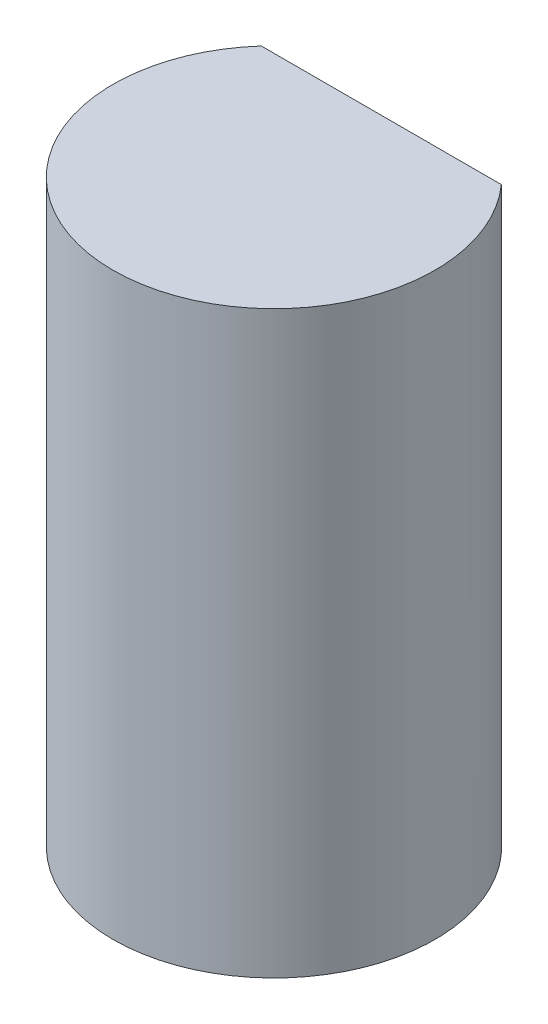
ISO-10303-21;
HEADER;
FILE_DESCRIPTION(('STEP AP214'),'2;1');
FILE_NAME('part.step','',(''),(''),'','','');
FILE_SCHEMA(('AUTOMOTIVE_DESIGN { 1 0 10303 214 1 1 1 1 }'));
ENDSEC;
DATA;
#1=APPLICATION_CONTEXT('core data for automotive mechanical design processes');
#2=APPLICATION_PROTOCOL_DEFINITION('international standard','automotive_design',2000,#1);
#3=PRODUCT_CONTEXT('',#1,'mechanical');
#4=PRODUCT('Part','Part','',(#3));
#5=PRODUCT_RELATED_PRODUCT_CATEGORY('part','',(#4));
#6=PRODUCT_DEFINITION_FORMATION('','',#4);
#7=PRODUCT_DEFINITION_CONTEXT('part definition',#1,'design');
#8=PRODUCT_DEFINITION('design','',#6,#7);
#9=PRODUCT_DEFINITION_SHAPE('','',#8);
#10=(LENGTH_UNIT() NAMED_UNIT(*) SI_UNIT(.MILLI.,.METRE.));
#11=(NAMED_UNIT(*) PLANE_ANGLE_UNIT() SI_UNIT($,.RADIAN.));
#12=(NAMED_UNIT(*) SI_UNIT($,.STERADIAN.) SOLID_ANGLE_UNIT());
#13=UNCERTAINTY_MEASURE_WITH_UNIT(LENGTH_MEASURE(1.E-05),#10,'distance_accuracy_value','');
#14=(GEOMETRIC_REPRESENTATION_CONTEXT(3) GLOBAL_UNCERTAINTY_ASSIGNED_CONTEXT((#13)) GLOBAL_UNIT_ASSIGNED_CONTEXT((#10,
#11,#12)) REPRESENTATION_CONTEXT('',''));
#15=CARTESIAN_POINT('',(0.,0.,0.));
#16=DIRECTION('',(0.,0.,1.));
#17=DIRECTION('',(1.,0.,0.));
#18=AXIS2_PLACEMENT_3D('',#15,#16,#17);
#19=CARTESIAN_POINT('',(0.,5.4,0.));
#20=DIRECTION('',(0.,-1.,0.));
#21=DIRECTION('',(0.,0.,-1.));
#22=AXIS2_PLACEMENT_3D('',#19,#20,#21);
#23=CYLINDRICAL_SURFACE('',#22,1.5);
#24=CARTESIAN_POINT('',(0.,5.4,0.));
#25=DIRECTION('',(0.,1.,0.));
#26=DIRECTION('',(0.,0.,1.));
#27=AXIS2_PLACEMENT_3D('',#24,#25,#26);
#28=CIRCLE('',#27,1.5);
#29=CARTESIAN_POINT('',(-1.1180339887499,5.4,-1.));
#30=VERTEX_POINT('',#29);
#31=CARTESIAN_POINT('',(1.1180339887499,5.4,-1.));
#32=VERTEX_POINT('',#31);
#33=EDGE_CURVE('E11',#30,#32,#28,.T.);
#34=ORIENTED_EDGE('',*,*,#33,.F.);
#35=DIRECTION('',(0.,1.,0.));
#36=VECTOR('',#35,1.);
#37=CARTESIAN_POINT('',(-1.1180339887499,1.7,-1.));
#38=LINE('',#37,#36);
#39=CARTESIAN_POINT('',(-1.1180339887499,1.7,-1.));
#40=VERTEX_POINT('',#39);
#41=EDGE_CURVE('E50',#40,#30,#38,.T.);
#42=ORIENTED_EDGE('',*,*,#41,.F.);
#43=CARTESIAN_POINT('',(0.,1.7,0.));
#44=DIRECTION('',(0.,1.,0.));
#45=DIRECTION('',(0.,0.,1.));
#46=AXIS2_PLACEMENT_3D('',#43,#44,#45);
#47=CIRCLE('',#46,1.5);
#48=CARTESIAN_POINT('',(1.1180339887499,1.7,-1.));
#49=VERTEX_POINT('',#48);
#50=EDGE_CURVE('E65',#49,#40,#47,.T.);
#51=ORIENTED_EDGE('',*,*,#50,.F.);
#52=DIRECTION('',(0.,1.,0.));
#53=VECTOR('',#52,1.);
#54=CARTESIAN_POINT('',(1.1180339887499,1.7,-1.));
#55=LINE('',#54,#53);
#56=EDGE_CURVE('E56',#49,#32,#55,.T.);
#57=ORIENTED_EDGE('',*,*,#56,.T.);
#58=EDGE_LOOP('',(#34,#42,#51,#57));
#59=FACE_BOUND('',#58,.T.);
#60=CARTESIAN_POINT('',(0.,0.,0.));
#61=DIRECTION('',(0.,1.,0.));
#62=DIRECTION('',(0.,0.,1.));
#63=AXIS2_PLACEMENT_3D('',#60,#61,#62);
#64=CIRCLE('',#63,1.5);
#65=CARTESIAN_POINT('',(0.,0.,1.5));
#66=VERTEX_POINT('',#65);
#67=EDGE_CURVE('E39',#66,#66,#64,.T.);
#68=ORIENTED_EDGE('',*,*,#67,.T.);
#69=EDGE_LOOP('',(#68));
#70=FACE_BOUND('',#69,.T.);
#71=ADVANCED_FACE('F36',(#59,#70),#23,.T.);
#72=CARTESIAN_POINT('',(0.,5.4,0.));
#73=DIRECTION('',(0.,1.,0.));
#74=DIRECTION('',(0.,0.,1.));
#75=AXIS2_PLACEMENT_3D('',#72,#73,#74);
#76=PLANE('',#75);
#77=DIRECTION('',(1.,0.,0.));
#78=VECTOR('',#77,1.);
#79=CARTESIAN_POINT('',(-1.1180339887499,5.4,-1.));
#80=LINE('',#79,#78);
#81=EDGE_CURVE('E61',#30,#32,#80,.T.);
#82=ORIENTED_EDGE('',*,*,#81,.F.);
#83=ORIENTED_EDGE('',*,*,#33,.T.);
#84=EDGE_LOOP('',(#82,#83));
#85=FACE_BOUND('',#84,.T.);
#86=ADVANCED_FACE('F71',(#85),#76,.T.);
#87=CARTESIAN_POINT('',(0.,0.,0.));
#88=DIRECTION('',(0.,1.,0.));
#89=DIRECTION('',(0.,0.,1.));
#90=AXIS2_PLACEMENT_3D('',#87,#88,#89);
#91=PLANE('',#90);
#92=ORIENTED_EDGE('',*,*,#67,.F.);
#93=EDGE_LOOP('',(#92));
#94=FACE_BOUND('',#93,.T.);
#95=ADVANCED_FACE('F73',(#94),#91,.F.);
#96=CARTESIAN_POINT('',(-1.1180339887499,1.7,-1.));
#97=DIRECTION('',(0.,0.,1.));
#98=DIRECTION('',(1.,0.,0.));
#99=AXIS2_PLACEMENT_3D('',#96,#97,#98);
#100=PLANE('',#99);
#101=ORIENTED_EDGE('',*,*,#81,.T.);
#102=ORIENTED_EDGE('',*,*,#56,.F.);
#103=DIRECTION('',(1.,0.,0.));
#104=VECTOR('',#103,1.);
#105=CARTESIAN_POINT('',(-1.1180339887499,1.7,-1.));
#106=LINE('',#105,#104);
#107=EDGE_CURVE('E88',#40,#49,#106,.T.);
#108=ORIENTED_EDGE('',*,*,#107,.F.);
#109=ORIENTED_EDGE('',*,*,#41,.T.);
#110=EDGE_LOOP('',(#101,#102,#108,#109));
#111=FACE_BOUND('',#110,.T.);
#112=ADVANCED_FACE('F62',(#111),#100,.F.);
#113=CARTESIAN_POINT('',(0.,1.7,0.));
#114=DIRECTION('',(0.,1.,0.));
#115=DIRECTION('',(0.,0.,1.));
#116=AXIS2_PLACEMENT_3D('',#113,#114,#115);
#117=PLANE('',#116);
#118=ORIENTED_EDGE('',*,*,#50,.T.);
#119=ORIENTED_EDGE('',*,*,#107,.T.);
#120=EDGE_LOOP('',(#118,#119));
#121=FACE_BOUND('',#120,.T.);
#122=ADVANCED_FACE('F83',(#121),#117,.T.);
#123=CLOSED_SHELL('',(#71,#86,#95,#112,#122));
#124=MANIFOLD_SOLID_BREP('B2',#123);
#125=ADVANCED_BREP_SHAPE_REPRESENTATION('',(#18,#124),#14);
#126=SHAPE_DEFINITION_REPRESENTATION(#9,#125);
ENDSEC;
END-ISO-10303-21;
